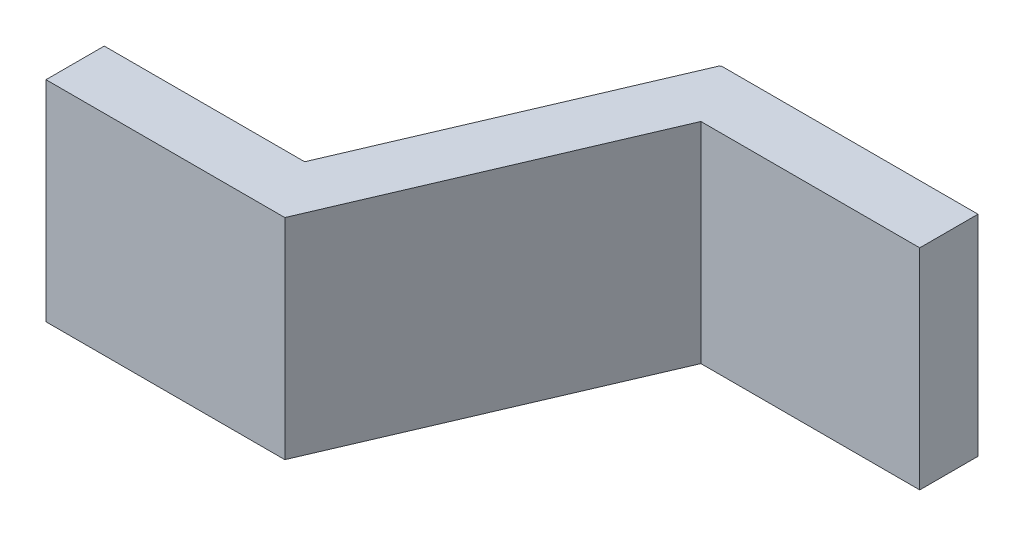
ISO-10303-21;
HEADER;
FILE_DESCRIPTION(('STEP AP214'),'2;1');
FILE_NAME('part.step','',(''),(''),'','','');
FILE_SCHEMA(('AUTOMOTIVE_DESIGN { 1 0 10303 214 1 1 1 1 }'));
ENDSEC;
DATA;
#1=APPLICATION_CONTEXT('core data for automotive mechanical design processes');
#2=APPLICATION_PROTOCOL_DEFINITION('international standard','automotive_design',2000,#1);
#3=PRODUCT_CONTEXT('',#1,'mechanical');
#4=PRODUCT('Part','Part','',(#3));
#5=PRODUCT_RELATED_PRODUCT_CATEGORY('part','',(#4));
#6=PRODUCT_DEFINITION_FORMATION('','',#4);
#7=PRODUCT_DEFINITION_CONTEXT('part definition',#1,'design');
#8=PRODUCT_DEFINITION('design','',#6,#7);
#9=PRODUCT_DEFINITION_SHAPE('','',#8);
#10=(LENGTH_UNIT() NAMED_UNIT(*) SI_UNIT(.MILLI.,.METRE.));
#11=(NAMED_UNIT(*) PLANE_ANGLE_UNIT() SI_UNIT($,.RADIAN.));
#12=(NAMED_UNIT(*) SI_UNIT($,.STERADIAN.) SOLID_ANGLE_UNIT());
#13=UNCERTAINTY_MEASURE_WITH_UNIT(LENGTH_MEASURE(1.E-05),#10,'distance_accuracy_value','');
#14=(GEOMETRIC_REPRESENTATION_CONTEXT(3) GLOBAL_UNCERTAINTY_ASSIGNED_CONTEXT((#13)) GLOBAL_UNIT_ASSIGNED_CONTEXT((#10,
#11,#12)) REPRESENTATION_CONTEXT('',''));
#15=CARTESIAN_POINT('',(0.,0.,0.));
#16=DIRECTION('',(0.,0.,1.));
#17=DIRECTION('',(1.,0.,0.));
#18=AXIS2_PLACEMENT_3D('',#15,#16,#17);
#19=CARTESIAN_POINT('',(11.558086453539,9.02,0.0006058345056003));
#20=DIRECTION('',(-0.919135450912914,0.,-0.393941649073963));
#21=DIRECTION('',(-0.393941649073963,0.,0.919135450912914));
#22=AXIS2_PLACEMENT_3D('',#19,#20,#21);
#23=PLANE('',#22);
#24=DIRECTION('',(0.,1.,0.));
#25=VECTOR('',#24,1.);
#26=CARTESIAN_POINT('',(11.344046008361,9.02,0.5));
#27=LINE('',#26,#25);
#28=CARTESIAN_POINT('',(11.344046008361,9.02,0.5));
#29=VERTEX_POINT('',#28);
#30=CARTESIAN_POINT('',(11.344046008361,9.380000014305,0.5));
#31=VERTEX_POINT('',#30);
#32=EDGE_CURVE('E94',#29,#31,#27,.T.);
#33=ORIENTED_EDGE('',*,*,#32,.T.);
#34=DIRECTION('',(-0.393941649073123,0.,0.919135450913275));
#35=VECTOR('',#34,1.);
#36=CARTESIAN_POINT('',(11.558086453539,9.380000014305,0.000605834505600302));
#37=LINE('',#36,#35);
#38=CARTESIAN_POINT('',(11.558086453539,9.380000014305,0.000605834505577237));
#39=VERTEX_POINT('',#38);
#40=EDGE_CURVE('E121',#39,#31,#37,.T.);
#41=ORIENTED_EDGE('',*,*,#40,.F.);
#42=DIRECTION('',(0.,1.,0.));
#43=VECTOR('',#42,1.);
#44=CARTESIAN_POINT('',(11.558086453539,9.02,0.000605834505554305));
#45=LINE('',#44,#43);
#46=CARTESIAN_POINT('',(11.558086453539,9.02,0.000605834505584969));
#47=VERTEX_POINT('',#46);
#48=EDGE_CURVE('E110',#39,#47,#45,.F.);
#49=ORIENTED_EDGE('',*,*,#48,.T.);
#50=DIRECTION('',(-0.393941649073123,0.,0.919135450913275));
#51=VECTOR('',#50,1.);
#52=CARTESIAN_POINT('',(11.558086453539,9.02,0.000605834505600302));
#53=LINE('',#52,#51);
#54=EDGE_CURVE('E100',#47,#29,#53,.T.);
#55=ORIENTED_EDGE('',*,*,#54,.T.);
#56=EDGE_LOOP('',(#33,#41,#49,#55));
#57=FACE_BOUND('',#56,.T.);
#58=ADVANCED_FACE('F17',(#57),#23,.T.);
#59=CARTESIAN_POINT('',(11.,9.02,0.5));
#60=DIRECTION('',(0.,0.,1.));
#61=DIRECTION('',(1.,0.,0.));
#62=AXIS2_PLACEMENT_3D('',#59,#60,#61);
#63=PLANE('',#62);
#64=DIRECTION('',(1.,0.,0.));
#65=VECTOR('',#64,1.);
#66=CARTESIAN_POINT('',(11.65,9.380000014305,0.5));
#67=LINE('',#66,#65);
#68=CARTESIAN_POINT('',(11.,9.380000014305,0.5));
#69=VERTEX_POINT('',#68);
#70=EDGE_CURVE('E79',#31,#69,#67,.F.);
#71=ORIENTED_EDGE('',*,*,#70,.F.);
#72=ORIENTED_EDGE('',*,*,#32,.F.);
#73=DIRECTION('',(1.,0.,0.));
#74=VECTOR('',#73,1.);
#75=CARTESIAN_POINT('',(11.65,9.02,0.5));
#76=LINE('',#75,#74);
#77=CARTESIAN_POINT('',(11.,9.02,0.5));
#78=VERTEX_POINT('',#77);
#79=EDGE_CURVE('E169',#29,#78,#76,.F.);
#80=ORIENTED_EDGE('',*,*,#79,.T.);
#81=DIRECTION('',(0.,1.,0.));
#82=VECTOR('',#81,1.);
#83=CARTESIAN_POINT('',(11.,9.02,0.5));
#84=LINE('',#83,#82);
#85=EDGE_CURVE('E87',#78,#69,#84,.T.);
#86=ORIENTED_EDGE('',*,*,#85,.T.);
#87=EDGE_LOOP('',(#71,#72,#80,#86));
#88=FACE_BOUND('',#87,.T.);
#89=ADVANCED_FACE('F198',(#88),#63,.F.);
#90=CARTESIAN_POINT('',(11.,9.02,0.5));
#91=DIRECTION('',(1.,0.,0.));
#92=DIRECTION('',(0.,0.,-1.));
#93=AXIS2_PLACEMENT_3D('',#90,#91,#92);
#94=PLANE('',#93);
#95=ORIENTED_EDGE('',*,*,#85,.F.);
#96=DIRECTION('',(0.,0.,1.));
#97=VECTOR('',#96,1.);
#98=CARTESIAN_POINT('',(11.,9.02,0.04));
#99=LINE('',#98,#97);
#100=CARTESIAN_POINT('',(11.,9.02,0.60000000149));
#101=VERTEX_POINT('',#100);
#102=EDGE_CURVE('E153',#78,#101,#99,.T.);
#103=ORIENTED_EDGE('',*,*,#102,.T.);
#104=DIRECTION('',(0.,1.,0.));
#105=VECTOR('',#104,1.);
#106=CARTESIAN_POINT('',(11.,9.02,0.60000000149));
#107=LINE('',#106,#105);
#108=CARTESIAN_POINT('',(11.,9.380000014305,0.60000000149));
#109=VERTEX_POINT('',#108);
#110=EDGE_CURVE('E117',#109,#101,#107,.F.);
#111=ORIENTED_EDGE('',*,*,#110,.F.);
#112=DIRECTION('',(0.,0.,1.));
#113=VECTOR('',#112,1.);
#114=CARTESIAN_POINT('',(11.,9.380000014305,0.04));
#115=LINE('',#114,#113);
#116=EDGE_CURVE('E71',#69,#109,#115,.T.);
#117=ORIENTED_EDGE('',*,*,#116,.F.);
#118=EDGE_LOOP('',(#95,#103,#111,#117));
#119=FACE_BOUND('',#118,.T.);
#120=ADVANCED_FACE('F202',(#119),#94,.F.);
#121=CARTESIAN_POINT('',(11.999999997616,9.02,0.));
#122=DIRECTION('',(1.,0.,0.));
#123=DIRECTION('',(0.,0.,-1.));
#124=AXIS2_PLACEMENT_3D('',#121,#122,#123);
#125=PLANE('',#124);
#126=DIRECTION('',(0.,0.,1.));
#127=VECTOR('',#126,1.);
#128=CARTESIAN_POINT('',(11.999999997616,9.02,0.04));
#129=LINE('',#128,#127);
#130=CARTESIAN_POINT('',(11.999999997616,9.02,0.10000000149));
#131=VERTEX_POINT('',#130);
#132=CARTESIAN_POINT('',(11.999999997616,9.02,0.));
#133=VERTEX_POINT('',#132);
#134=EDGE_CURVE('E179',#131,#133,#129,.F.);
#135=ORIENTED_EDGE('',*,*,#134,.T.);
#136=DIRECTION('',(0.,1.,0.));
#137=VECTOR('',#136,1.);
#138=CARTESIAN_POINT('',(11.999999997616,9.02,0.));
#139=LINE('',#138,#137);
#140=CARTESIAN_POINT('',(11.999999997616,9.380000014305,0.));
#141=VERTEX_POINT('',#140);
#142=EDGE_CURVE('E174',#133,#141,#139,.T.);
#143=ORIENTED_EDGE('',*,*,#142,.T.);
#144=DIRECTION('',(0.,0.,1.));
#145=VECTOR('',#144,1.);
#146=CARTESIAN_POINT('',(11.999999997616,9.380000014305,0.04));
#147=LINE('',#146,#145);
#148=CARTESIAN_POINT('',(11.999999997616,9.380000014305,0.10000000149));
#149=VERTEX_POINT('',#148);
#150=EDGE_CURVE('E155',#149,#141,#147,.F.);
#151=ORIENTED_EDGE('',*,*,#150,.F.);
#152=DIRECTION('',(0.,1.,0.));
#153=VECTOR('',#152,1.);
#154=CARTESIAN_POINT('',(11.999999997616,9.02,0.10000000149));
#155=LINE('',#154,#153);
#156=EDGE_CURVE('E125',#131,#149,#155,.T.);
#157=ORIENTED_EDGE('',*,*,#156,.F.);
#158=EDGE_LOOP('',(#135,#143,#151,#157));
#159=FACE_BOUND('',#158,.T.);
#160=ADVANCED_FACE('F228',(#159),#125,.T.);
#161=CARTESIAN_POINT('',(11.56,9.02,0.));
#162=DIRECTION('',(0.,0.,1.));
#163=DIRECTION('',(1.,0.,0.));
#164=AXIS2_PLACEMENT_3D('',#161,#162,#163);
#165=PLANE('',#164);
#166=DIRECTION('',(1.,0.,0.));
#167=VECTOR('',#166,1.);
#168=CARTESIAN_POINT('',(11.65,9.02,0.));
#169=LINE('',#168,#167);
#170=CARTESIAN_POINT('',(11.56,9.02,0.));
#171=VERTEX_POINT('',#170);
#172=EDGE_CURVE('E150',#133,#171,#169,.F.);
#173=ORIENTED_EDGE('',*,*,#172,.T.);
#174=DIRECTION('',(0.,1.,0.));
#175=VECTOR('',#174,1.);
#176=CARTESIAN_POINT('',(11.56,9.02,0.));
#177=LINE('',#176,#175);
#178=CARTESIAN_POINT('',(11.56,9.380000014305,0.));
#179=VERTEX_POINT('',#178);
#180=EDGE_CURVE('E164',#171,#179,#177,.T.);
#181=ORIENTED_EDGE('',*,*,#180,.T.);
#182=DIRECTION('',(1.,0.,0.));
#183=VECTOR('',#182,1.);
#184=CARTESIAN_POINT('',(11.65,9.380000014305,0.));
#185=LINE('',#184,#183);
#186=EDGE_CURVE('E154',#141,#179,#185,.F.);
#187=ORIENTED_EDGE('',*,*,#186,.F.);
#188=ORIENTED_EDGE('',*,*,#142,.F.);
#189=EDGE_LOOP('',(#173,#181,#187,#188));
#190=FACE_BOUND('',#189,.T.);
#191=ADVANCED_FACE('F232',(#190),#165,.F.);
#192=CARTESIAN_POINT('',(11.56,9.02,0.));
#193=DIRECTION('',(1.,0.,0.));
#194=DIRECTION('',(0.,0.,-1.));
#195=AXIS2_PLACEMENT_3D('',#192,#193,#194);
#196=PLANE('',#195);
#197=DIRECTION('',(0.,1.,0.));
#198=VECTOR('',#197,1.);
#199=CARTESIAN_POINT('',(11.56,9.02,0.00142598092431268));
#200=LINE('',#199,#198);
#201=CARTESIAN_POINT('',(11.56,9.02,0.00142598092431734));
#202=VERTEX_POINT('',#201);
#203=CARTESIAN_POINT('',(11.56,9.380000014305,0.00142598092431734));
#204=VERTEX_POINT('',#203);
#205=EDGE_CURVE('E118',#202,#204,#200,.T.);
#206=ORIENTED_EDGE('',*,*,#205,.T.);
#207=DIRECTION('',(0.,0.,1.));
#208=VECTOR('',#207,1.);
#209=CARTESIAN_POINT('',(11.56,9.380000014305,0.04));
#210=LINE('',#209,#208);
#211=EDGE_CURVE('E123',#179,#204,#210,.T.);
#212=ORIENTED_EDGE('',*,*,#211,.F.);
#213=ORIENTED_EDGE('',*,*,#180,.F.);
#214=DIRECTION('',(0.,0.,-1.));
#215=VECTOR('',#214,1.);
#216=CARTESIAN_POINT('',(11.56,9.02,0.));
#217=LINE('',#216,#215);
#218=EDGE_CURVE('E147',#171,#202,#217,.F.);
#219=ORIENTED_EDGE('',*,*,#218,.T.);
#220=EDGE_LOOP('',(#206,#212,#213,#219));
#221=FACE_BOUND('',#220,.T.);
#222=ADVANCED_FACE('F234',(#221),#196,.F.);
#223=CARTESIAN_POINT('',(11.65,9.02,0.04));
#224=DIRECTION('',(-0.393941649073963,0.,0.919135450912914));
#225=DIRECTION('',(0.919135450912914,0.,0.393941649073963));
#226=AXIS2_PLACEMENT_3D('',#223,#224,#225);
#227=PLANE('',#226);
#228=DIRECTION('',(-0.919135450920459,0.,-0.393941649056361));
#229=VECTOR('',#228,1.);
#230=CARTESIAN_POINT('',(11.56,9.380000014305,0.001425980924322));
#231=LINE('',#230,#229);
#232=EDGE_CURVE('E113',#204,#39,#231,.T.);
#233=ORIENTED_EDGE('',*,*,#232,.F.);
#234=ORIENTED_EDGE('',*,*,#205,.F.);
#235=DIRECTION('',(-0.919135450920459,0.,-0.393941649056361));
#236=VECTOR('',#235,1.);
#237=CARTESIAN_POINT('',(11.56,9.02,0.001425980924322));
#238=LINE('',#237,#236);
#239=EDGE_CURVE('E114',#202,#47,#238,.T.);
#240=ORIENTED_EDGE('',*,*,#239,.T.);
#241=ORIENTED_EDGE('',*,*,#48,.F.);
#242=EDGE_LOOP('',(#233,#234,#240,#241));
#243=FACE_BOUND('',#242,.T.);
#244=ADVANCED_FACE('F112',(#243),#227,.F.);
#245=CARTESIAN_POINT('',(11.,9.02,0.60000000149));
#246=DIRECTION('',(0.,0.,1.));
#247=DIRECTION('',(1.,0.,0.));
#248=AXIS2_PLACEMENT_3D('',#245,#246,#247);
#249=PLANE('',#248);
#250=DIRECTION('',(0.,1.,0.));
#251=VECTOR('',#250,1.);
#252=CARTESIAN_POINT('',(11.4099838806682,9.02,0.60000000149));
#253=LINE('',#252,#251);
#254=CARTESIAN_POINT('',(11.4099838806682,9.02,0.60000000149));
#255=VERTEX_POINT('',#254);
#256=CARTESIAN_POINT('',(11.4099838806682,9.380000014305,0.60000000149));
#257=VERTEX_POINT('',#256);
#258=EDGE_CURVE('E144',#255,#257,#253,.T.);
#259=ORIENTED_EDGE('',*,*,#258,.T.);
#260=DIRECTION('',(1.,0.,0.));
#261=VECTOR('',#260,1.);
#262=CARTESIAN_POINT('',(11.65,9.380000014305,0.60000000149));
#263=LINE('',#262,#261);
#264=EDGE_CURVE('E20',#109,#257,#263,.T.);
#265=ORIENTED_EDGE('',*,*,#264,.F.);
#266=ORIENTED_EDGE('',*,*,#110,.T.);
#267=DIRECTION('',(1.,0.,0.));
#268=VECTOR('',#267,1.);
#269=CARTESIAN_POINT('',(11.,9.02,0.60000000149));
#270=LINE('',#269,#268);
#271=EDGE_CURVE('E151',#101,#255,#270,.T.);
#272=ORIENTED_EDGE('',*,*,#271,.T.);
#273=EDGE_LOOP('',(#259,#265,#266,#272));
#274=FACE_BOUND('',#273,.T.);
#275=ADVANCED_FACE('F205',(#274),#249,.T.);
#276=CARTESIAN_POINT('',(11.65,9.380000014305,0.04));
#277=DIRECTION('',(0.,1.,0.));
#278=DIRECTION('',(0.,0.,1.));
#279=AXIS2_PLACEMENT_3D('',#276,#277,#278);
#280=PLANE('',#279);
#281=ORIENTED_EDGE('',*,*,#211,.T.);
#282=ORIENTED_EDGE('',*,*,#232,.T.);
#283=ORIENTED_EDGE('',*,*,#40,.T.);
#284=ORIENTED_EDGE('',*,*,#70,.T.);
#285=ORIENTED_EDGE('',*,*,#116,.T.);
#286=ORIENTED_EDGE('',*,*,#264,.T.);
#287=DIRECTION('',(-0.393941649073964,0.,0.919135450912914));
#288=VECTOR('',#287,1.);
#289=CARTESIAN_POINT('',(11.6242839866442,9.380000014305,0.100000001490094));
#290=LINE('',#289,#288);
#291=CARTESIAN_POINT('',(11.6242839866442,9.380000014305,0.100000001490047));
#292=VERTEX_POINT('',#291);
#293=EDGE_CURVE('E141',#257,#292,#290,.F.);
#294=ORIENTED_EDGE('',*,*,#293,.T.);
#295=DIRECTION('',(1.,0.,0.));
#296=VECTOR('',#295,1.);
#297=CARTESIAN_POINT('',(11.56,9.380000014305,0.10000000149));
#298=LINE('',#297,#296);
#299=EDGE_CURVE('E170',#149,#292,#298,.F.);
#300=ORIENTED_EDGE('',*,*,#299,.F.);
#301=ORIENTED_EDGE('',*,*,#150,.T.);
#302=ORIENTED_EDGE('',*,*,#186,.T.);
#303=EDGE_LOOP('',(#281,#282,#283,#284,#285,#286,#294,#300,#301,#302));
#304=FACE_BOUND('',#303,.T.);
#305=ADVANCED_FACE('F120',(#304),#280,.T.);
#306=CARTESIAN_POINT('',(11.56,9.02,0.10000000149));
#307=DIRECTION('',(0.,0.,1.));
#308=DIRECTION('',(1.,0.,0.));
#309=AXIS2_PLACEMENT_3D('',#306,#307,#308);
#310=PLANE('',#309);
#311=ORIENTED_EDGE('',*,*,#299,.T.);
#312=DIRECTION('',(0.,1.,0.));
#313=VECTOR('',#312,1.);
#314=CARTESIAN_POINT('',(11.6242839866442,9.02,0.100000001490094));
#315=LINE('',#314,#313);
#316=CARTESIAN_POINT('',(11.6242839866442,9.02,0.100000001490047));
#317=VERTEX_POINT('',#316);
#318=EDGE_CURVE('E26',#292,#317,#315,.F.);
#319=ORIENTED_EDGE('',*,*,#318,.T.);
#320=DIRECTION('',(1.,0.,0.));
#321=VECTOR('',#320,1.);
#322=CARTESIAN_POINT('',(11.65,9.02,0.10000000149));
#323=LINE('',#322,#321);
#324=EDGE_CURVE('E34',#317,#131,#323,.T.);
#325=ORIENTED_EDGE('',*,*,#324,.T.);
#326=ORIENTED_EDGE('',*,*,#156,.T.);
#327=EDGE_LOOP('',(#311,#319,#325,#326));
#328=FACE_BOUND('',#327,.T.);
#329=ADVANCED_FACE('F223',(#328),#310,.T.);
#330=CARTESIAN_POINT('',(11.65,9.02,0.04));
#331=DIRECTION('',(0.,1.,0.));
#332=DIRECTION('',(0.,0.,1.));
#333=AXIS2_PLACEMENT_3D('',#330,#331,#332);
#334=PLANE('',#333);
#335=ORIENTED_EDGE('',*,*,#218,.F.);
#336=ORIENTED_EDGE('',*,*,#172,.F.);
#337=ORIENTED_EDGE('',*,*,#134,.F.);
#338=ORIENTED_EDGE('',*,*,#324,.F.);
#339=DIRECTION('',(0.393941649073964,0.,-0.919135450912914));
#340=VECTOR('',#339,1.);
#341=CARTESIAN_POINT('',(11.4098164411035,9.02,0.600390667570103));
#342=LINE('',#341,#340);
#343=EDGE_CURVE('E11',#317,#255,#342,.F.);
#344=ORIENTED_EDGE('',*,*,#343,.T.);
#345=ORIENTED_EDGE('',*,*,#271,.F.);
#346=ORIENTED_EDGE('',*,*,#102,.F.);
#347=ORIENTED_EDGE('',*,*,#79,.F.);
#348=ORIENTED_EDGE('',*,*,#54,.F.);
#349=ORIENTED_EDGE('',*,*,#239,.F.);
#350=EDGE_LOOP('',(#335,#336,#337,#338,#344,#345,#346,#347,#348,#349));
#351=FACE_BOUND('',#350,.T.);
#352=ADVANCED_FACE('F200',(#351),#334,.F.);
#353=CARTESIAN_POINT('',(11.65,9.02,0.04));
#354=DIRECTION('',(-0.919135450912914,0.,-0.393941649073963));
#355=DIRECTION('',(-0.393941649073963,0.,0.919135450912914));
#356=AXIS2_PLACEMENT_3D('',#353,#354,#355);
#357=PLANE('',#356);
#358=ORIENTED_EDGE('',*,*,#318,.F.);
#359=ORIENTED_EDGE('',*,*,#293,.F.);
#360=ORIENTED_EDGE('',*,*,#258,.F.);
#361=ORIENTED_EDGE('',*,*,#343,.F.);
#362=EDGE_LOOP('',(#358,#359,#360,#361));
#363=FACE_BOUND('',#362,.T.);
#364=ADVANCED_FACE('F210',(#363),#357,.F.);
#365=CLOSED_SHELL('',(#58,#89,#120,#160,#191,#222,#244,#275,#305,#329,#352,#364));
#366=MANIFOLD_SOLID_BREP('B1',#365);
#367=ADVANCED_BREP_SHAPE_REPRESENTATION('',(#18,#366),#14);
#368=SHAPE_DEFINITION_REPRESENTATION(#9,#367);
ENDSEC;
END-ISO-10303-21;
